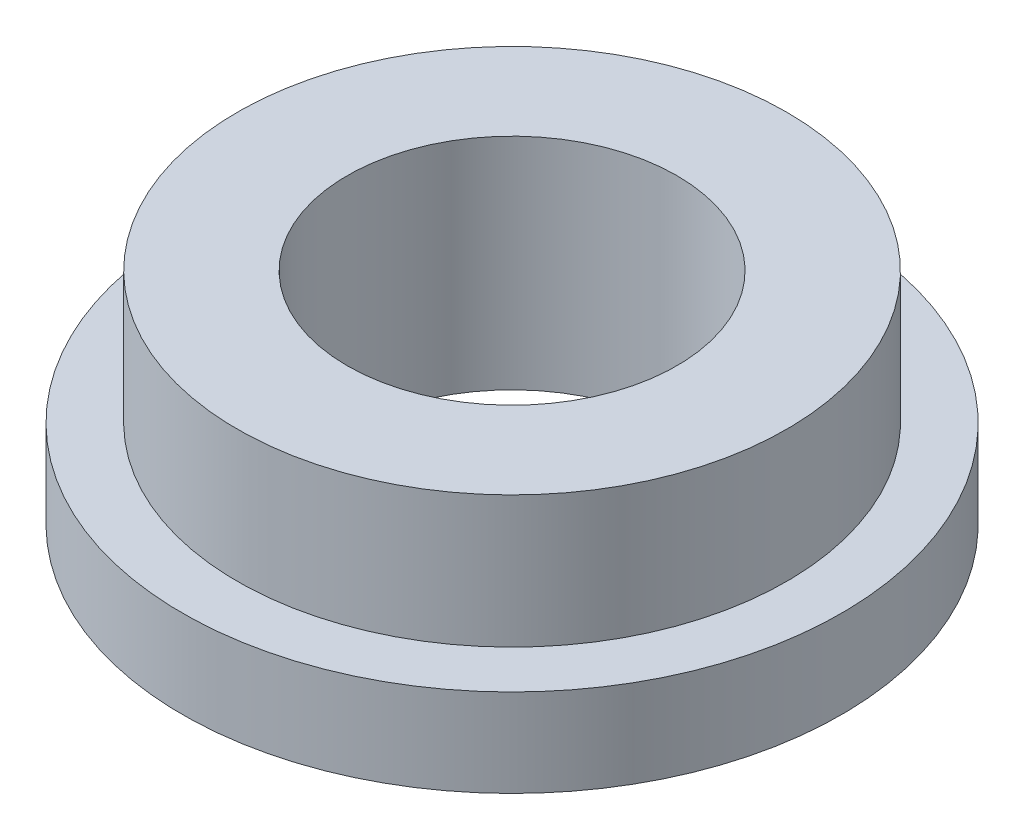
ISO-10303-21;
HEADER;
FILE_DESCRIPTION(('STEP AP214'),'2;1');
FILE_NAME('part.step','',(''),(''),'','','');
FILE_SCHEMA(('AUTOMOTIVE_DESIGN { 1 0 10303 214 1 1 1 1 }'));
ENDSEC;
DATA;
#1=APPLICATION_CONTEXT('core data for automotive mechanical design processes');
#2=APPLICATION_PROTOCOL_DEFINITION('international standard','automotive_design',2000,#1);
#3=PRODUCT_CONTEXT('',#1,'mechanical');
#4=PRODUCT('Part','Part','',(#3));
#5=PRODUCT_RELATED_PRODUCT_CATEGORY('part','',(#4));
#6=PRODUCT_DEFINITION_FORMATION('','',#4);
#7=PRODUCT_DEFINITION_CONTEXT('part definition',#1,'design');
#8=PRODUCT_DEFINITION('design','',#6,#7);
#9=PRODUCT_DEFINITION_SHAPE('','',#8);
#10=(LENGTH_UNIT() NAMED_UNIT(*) SI_UNIT(.MILLI.,.METRE.));
#11=(NAMED_UNIT(*) PLANE_ANGLE_UNIT() SI_UNIT($,.RADIAN.));
#12=(NAMED_UNIT(*) SI_UNIT($,.STERADIAN.) SOLID_ANGLE_UNIT());
#13=UNCERTAINTY_MEASURE_WITH_UNIT(LENGTH_MEASURE(1.E-05),#10,'distance_accuracy_value','');
#14=(GEOMETRIC_REPRESENTATION_CONTEXT(3) GLOBAL_UNCERTAINTY_ASSIGNED_CONTEXT((#13)) GLOBAL_UNIT_ASSIGNED_CONTEXT((#10,
#11,#12)) REPRESENTATION_CONTEXT('',''));
#15=CARTESIAN_POINT('',(0.,0.,0.));
#16=DIRECTION('',(0.,0.,1.));
#17=DIRECTION('',(1.,0.,0.));
#18=AXIS2_PLACEMENT_3D('',#15,#16,#17);
#19=CARTESIAN_POINT('',(0.,0.,-6.));
#20=DIRECTION('',(0.,-1.,0.));
#21=DIRECTION('',(0.,0.,-1.));
#22=AXIS2_PLACEMENT_3D('',#19,#20,#21);
#23=PLANE('',#22);
#24=CARTESIAN_POINT('',(0.,0.,0.));
#25=DIRECTION('',(0.,-1.,0.));
#26=DIRECTION('',(0.,0.,-1.));
#27=AXIS2_PLACEMENT_3D('',#24,#25,#26);
#28=CIRCLE('',#27,6.);
#29=CARTESIAN_POINT('',(0.,0.,-6.));
#30=VERTEX_POINT('',#29);
#31=EDGE_CURVE('E61',#30,#30,#28,.T.);
#32=ORIENTED_EDGE('',*,*,#31,.T.);
#33=EDGE_LOOP('',(#32));
#34=FACE_BOUND('',#33,.T.);
#35=CARTESIAN_POINT('',(0.,0.,0.));
#36=DIRECTION('',(0.,-1.,0.));
#37=DIRECTION('',(0.,0.,-1.));
#38=AXIS2_PLACEMENT_3D('',#35,#36,#37);
#39=CIRCLE('',#38,3.);
#40=CARTESIAN_POINT('',(0.,0.,-3.));
#41=VERTEX_POINT('',#40);
#42=EDGE_CURVE('E10',#41,#41,#39,.T.);
#43=ORIENTED_EDGE('',*,*,#42,.F.);
#44=EDGE_LOOP('',(#43));
#45=FACE_BOUND('',#44,.T.);
#46=ADVANCED_FACE('F39',(#34,#45),#23,.T.);
#47=CARTESIAN_POINT('',(0.,-11.7,0.));
#48=DIRECTION('',(0.,-1.,0.));
#49=DIRECTION('',(0.,0.,-1.));
#50=AXIS2_PLACEMENT_3D('',#47,#48,#49);
#51=CYLINDRICAL_SURFACE('',#50,3.);
#52=ORIENTED_EDGE('',*,*,#42,.T.);
#53=EDGE_LOOP('',(#52));
#54=FACE_BOUND('',#53,.T.);
#55=CARTESIAN_POINT('',(0.,4.,0.));
#56=DIRECTION('',(0.,-1.,0.));
#57=DIRECTION('',(0.,0.,-1.));
#58=AXIS2_PLACEMENT_3D('',#55,#56,#57);
#59=CIRCLE('',#58,3.);
#60=CARTESIAN_POINT('',(0.,4.,-3.));
#61=VERTEX_POINT('',#60);
#62=EDGE_CURVE('E45',#61,#61,#59,.T.);
#63=ORIENTED_EDGE('',*,*,#62,.F.);
#64=EDGE_LOOP('',(#63));
#65=FACE_BOUND('',#64,.T.);
#66=ADVANCED_FACE('F79',(#54,#65),#51,.F.);
#67=CARTESIAN_POINT('',(0.,4.,-3.));
#68=DIRECTION('',(0.,1.,0.));
#69=DIRECTION('',(0.,0.,1.));
#70=AXIS2_PLACEMENT_3D('',#67,#68,#69);
#71=PLANE('',#70);
#72=ORIENTED_EDGE('',*,*,#62,.T.);
#73=EDGE_LOOP('',(#72));
#74=FACE_BOUND('',#73,.T.);
#75=CARTESIAN_POINT('',(0.,4.,0.));
#76=DIRECTION('',(0.,-1.,0.));
#77=DIRECTION('',(0.,0.,-1.));
#78=AXIS2_PLACEMENT_3D('',#75,#76,#77);
#79=CIRCLE('',#78,5.);
#80=CARTESIAN_POINT('',(0.,4.,-5.));
#81=VERTEX_POINT('',#80);
#82=EDGE_CURVE('E49',#81,#81,#79,.T.);
#83=ORIENTED_EDGE('',*,*,#82,.F.);
#84=EDGE_LOOP('',(#83));
#85=FACE_BOUND('',#84,.T.);
#86=ADVANCED_FACE('F83',(#74,#85),#71,.T.);
#87=CARTESIAN_POINT('',(0.,-11.7,0.));
#88=DIRECTION('',(0.,-1.,0.));
#89=DIRECTION('',(0.,0.,-1.));
#90=AXIS2_PLACEMENT_3D('',#87,#88,#89);
#91=CYLINDRICAL_SURFACE('',#90,5.);
#92=ORIENTED_EDGE('',*,*,#82,.T.);
#93=EDGE_LOOP('',(#92));
#94=FACE_BOUND('',#93,.T.);
#95=CARTESIAN_POINT('',(0.,1.6,0.));
#96=DIRECTION('',(0.,-1.,0.));
#97=DIRECTION('',(0.,0.,-1.));
#98=AXIS2_PLACEMENT_3D('',#95,#96,#97);
#99=CIRCLE('',#98,5.);
#100=CARTESIAN_POINT('',(0.,1.6,-5.));
#101=VERTEX_POINT('',#100);
#102=EDGE_CURVE('E53',#101,#101,#99,.T.);
#103=ORIENTED_EDGE('',*,*,#102,.F.);
#104=EDGE_LOOP('',(#103));
#105=FACE_BOUND('',#104,.T.);
#106=ADVANCED_FACE('F75',(#94,#105),#91,.T.);
#107=CARTESIAN_POINT('',(0.,1.6,-5.));
#108=DIRECTION('',(0.,1.,0.));
#109=DIRECTION('',(0.,0.,1.));
#110=AXIS2_PLACEMENT_3D('',#107,#108,#109);
#111=PLANE('',#110);
#112=ORIENTED_EDGE('',*,*,#102,.T.);
#113=EDGE_LOOP('',(#112));
#114=FACE_BOUND('',#113,.T.);
#115=CARTESIAN_POINT('',(0.,1.6,0.));
#116=DIRECTION('',(0.,-1.,0.));
#117=DIRECTION('',(0.,0.,-1.));
#118=AXIS2_PLACEMENT_3D('',#115,#116,#117);
#119=CIRCLE('',#118,6.);
#120=CARTESIAN_POINT('',(0.,1.6,-6.));
#121=VERTEX_POINT('',#120);
#122=EDGE_CURVE('E58',#121,#121,#119,.T.);
#123=ORIENTED_EDGE('',*,*,#122,.F.);
#124=EDGE_LOOP('',(#123));
#125=FACE_BOUND('',#124,.T.);
#126=ADVANCED_FACE('F69',(#114,#125),#111,.T.);
#127=CARTESIAN_POINT('',(0.,-11.7,0.));
#128=DIRECTION('',(0.,-1.,0.));
#129=DIRECTION('',(0.,0.,-1.));
#130=AXIS2_PLACEMENT_3D('',#127,#128,#129);
#131=CYLINDRICAL_SURFACE('',#130,6.);
#132=ORIENTED_EDGE('',*,*,#122,.T.);
#133=EDGE_LOOP('',(#132));
#134=FACE_BOUND('',#133,.T.);
#135=ORIENTED_EDGE('',*,*,#31,.F.);
#136=EDGE_LOOP('',(#135));
#137=FACE_BOUND('',#136,.T.);
#138=ADVANCED_FACE('F67',(#134,#137),#131,.T.);
#139=CLOSED_SHELL('',(#46,#66,#86,#106,#126,#138));
#140=MANIFOLD_SOLID_BREP('B2',#139);
#141=ADVANCED_BREP_SHAPE_REPRESENTATION('',(#18,#140),#14);
#142=SHAPE_DEFINITION_REPRESENTATION(#9,#141);
ENDSEC;
END-ISO-10303-21;
